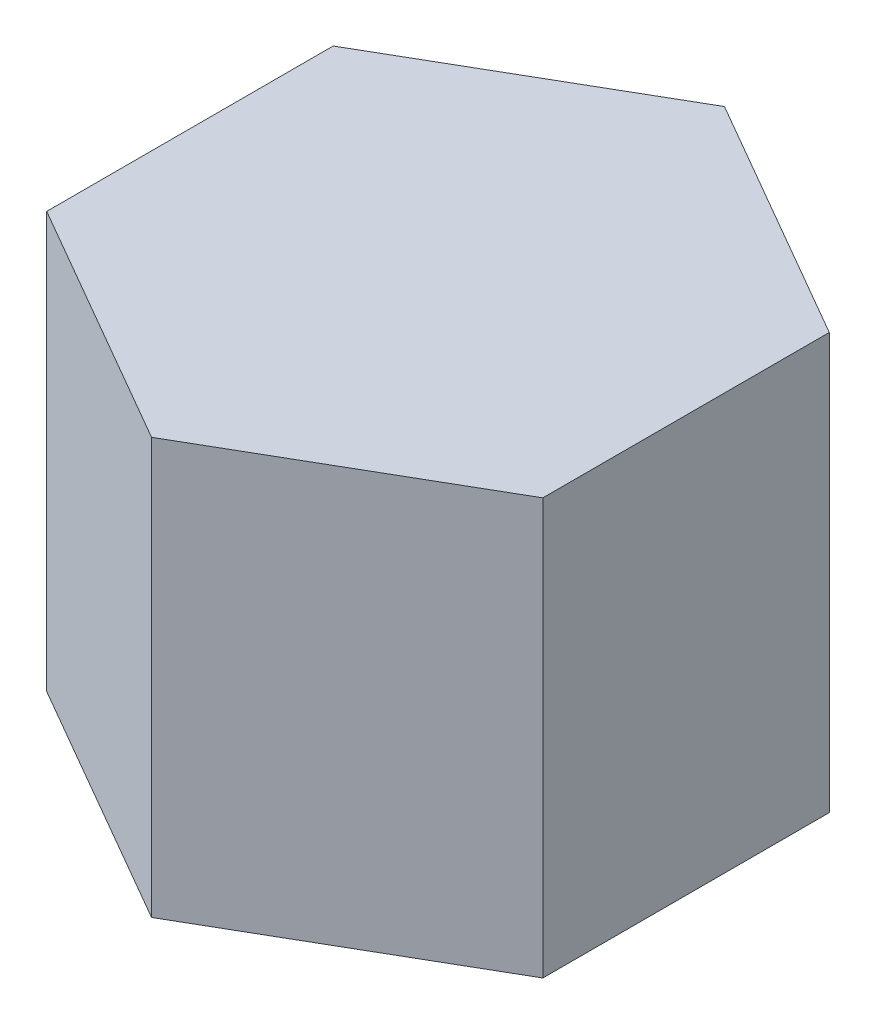
ISO-10303-21;
HEADER;
FILE_DESCRIPTION(('STEP AP214'),'2;1');
FILE_NAME('part.step','',(''),(''),'','','');
FILE_SCHEMA(('AUTOMOTIVE_DESIGN { 1 0 10303 214 1 1 1 1 }'));
ENDSEC;
DATA;
#1=APPLICATION_CONTEXT('core data for automotive mechanical design processes');
#2=APPLICATION_PROTOCOL_DEFINITION('international standard','automotive_design',2000,#1);
#3=PRODUCT_CONTEXT('',#1,'mechanical');
#4=PRODUCT('Part','Part','',(#3));
#5=PRODUCT_RELATED_PRODUCT_CATEGORY('part','',(#4));
#6=PRODUCT_DEFINITION_FORMATION('','',#4);
#7=PRODUCT_DEFINITION_CONTEXT('part definition',#1,'design');
#8=PRODUCT_DEFINITION('design','',#6,#7);
#9=PRODUCT_DEFINITION_SHAPE('','',#8);
#10=(LENGTH_UNIT() NAMED_UNIT(*) SI_UNIT(.MILLI.,.METRE.));
#11=(NAMED_UNIT(*) PLANE_ANGLE_UNIT() SI_UNIT($,.RADIAN.));
#12=(NAMED_UNIT(*) SI_UNIT($,.STERADIAN.) SOLID_ANGLE_UNIT());
#13=UNCERTAINTY_MEASURE_WITH_UNIT(LENGTH_MEASURE(1.E-05),#10,'distance_accuracy_value','');
#14=(GEOMETRIC_REPRESENTATION_CONTEXT(3) GLOBAL_UNCERTAINTY_ASSIGNED_CONTEXT((#13)) GLOBAL_UNIT_ASSIGNED_CONTEXT((#10,
#11,#12)) REPRESENTATION_CONTEXT('',''));
#15=CARTESIAN_POINT('',(0.,0.,0.));
#16=DIRECTION('',(0.,0.,1.));
#17=DIRECTION('',(1.,0.,0.));
#18=AXIS2_PLACEMENT_3D('',#15,#16,#17);
#19=CARTESIAN_POINT('',(209.642660308706,-148.537700895744,293.239022028063));
#20=DIRECTION('',(-0.499999999999909,0.,-0.866025403784491));
#21=DIRECTION('',(-0.866025403784491,0.,0.499999999999909));
#22=AXIS2_PLACEMENT_3D('',#19,#20,#21);
#23=PLANE('',#22);
#24=CARTESIAN_POINT('',(209.339551417382,-149.045793579175,293.414022028063));
#25=DIRECTION('',(0.866025403784491,0.,-0.499999999999909));
#26=VECTOR('',#25,1.);
#27=LINE('',#24,#26);
#28=CARTESIAN_POINT('',(209.339551417382,-149.045793579175,293.414022028063));
#29=VERTEX_POINT('',#28);
#30=CARTESIAN_POINT('',(209.642660308706,-149.045793579175,293.239022028063));
#31=VERTEX_POINT('',#30);
#32=EDGE_CURVE('E170',#29,#31,#27,.T.);
#33=ORIENTED_EDGE('',*,*,#32,.T.);
#34=CARTESIAN_POINT('',(209.642660308706,-148.537700895744,293.239022028063));
#35=DIRECTION('',(0.,-1.,0.));
#36=VECTOR('',#35,1.);
#37=LINE('',#34,#36);
#38=CARTESIAN_POINT('',(209.642660308706,-148.537700895744,293.239022028063));
#39=VERTEX_POINT('',#38);
#40=EDGE_CURVE('E35',#39,#31,#37,.T.);
#41=ORIENTED_EDGE('',*,*,#40,.F.);
#42=CARTESIAN_POINT('',(209.339551417382,-148.537700895744,293.414022028063));
#43=DIRECTION('',(0.866025403784491,0.,-0.499999999999909));
#44=VECTOR('',#43,1.);
#45=LINE('',#42,#44);
#46=CARTESIAN_POINT('',(209.339551417382,-148.537700895744,293.414022028063));
#47=VERTEX_POINT('',#46);
#48=EDGE_CURVE('E159',#47,#39,#45,.T.);
#49=ORIENTED_EDGE('',*,*,#48,.F.);
#50=CARTESIAN_POINT('',(209.339551417382,-148.537700895744,293.414022028063));
#51=DIRECTION('',(0.,-1.,0.));
#52=VECTOR('',#51,1.);
#53=LINE('',#50,#52);
#54=EDGE_CURVE('E10',#47,#29,#53,.T.);
#55=ORIENTED_EDGE('',*,*,#54,.T.);
#56=EDGE_LOOP('',(#33,#41,#49,#55));
#57=FACE_BOUND('',#56,.T.);
#58=ADVANCED_FACE('F16',(#57),#23,.F.);
#59=CARTESIAN_POINT('',(209.339551417382,-148.537700895744,293.414022028063));
#60=DIRECTION('',(0.500000000000096,0.,-0.866025403784383));
#61=DIRECTION('',(-0.866025403784383,0.,-0.500000000000096));
#62=AXIS2_PLACEMENT_3D('',#59,#60,#61);
#63=PLANE('',#62);
#64=CARTESIAN_POINT('',(209.036442526057,-149.045793579175,293.239022028063));
#65=DIRECTION('',(0.866025403784383,0.,0.500000000000096));
#66=VECTOR('',#65,1.);
#67=LINE('',#64,#66);
#68=CARTESIAN_POINT('',(209.036442526057,-149.045793579175,293.239022028063));
#69=VERTEX_POINT('',#68);
#70=EDGE_CURVE('E167',#69,#29,#67,.T.);
#71=ORIENTED_EDGE('',*,*,#70,.T.);
#72=ORIENTED_EDGE('',*,*,#54,.F.);
#73=CARTESIAN_POINT('',(209.036442526057,-148.537700895744,293.239022028063));
#74=DIRECTION('',(0.866025403784383,0.,0.500000000000096));
#75=VECTOR('',#74,1.);
#76=LINE('',#73,#75);
#77=CARTESIAN_POINT('',(209.036442526057,-148.537700895744,293.239022028063));
#78=VERTEX_POINT('',#77);
#79=EDGE_CURVE('E156',#78,#47,#76,.T.);
#80=ORIENTED_EDGE('',*,*,#79,.F.);
#81=CARTESIAN_POINT('',(209.036442526057,-148.537700895744,293.239022028063));
#82=DIRECTION('',(0.,-1.,0.));
#83=VECTOR('',#82,1.);
#84=LINE('',#81,#83);
#85=EDGE_CURVE('E27',#78,#69,#84,.T.);
#86=ORIENTED_EDGE('',*,*,#85,.T.);
#87=EDGE_LOOP('',(#71,#72,#80,#86));
#88=FACE_BOUND('',#87,.T.);
#89=ADVANCED_FACE('F189',(#88),#63,.F.);
#90=CARTESIAN_POINT('',(209.036442526057,-148.537700895744,290.831971220494));
#91=DIRECTION('',(1.,0.,0.));
#92=DIRECTION('',(0.,1.,0.));
#93=AXIS2_PLACEMENT_3D('',#90,#91,#92);
#94=PLANE('',#93);
#95=CARTESIAN_POINT('',(209.036442526057,-149.045793579175,292.889022028063));
#96=DIRECTION('',(0.,0.,1.));
#97=VECTOR('',#96,1.);
#98=LINE('',#95,#97);
#99=CARTESIAN_POINT('',(209.036442526057,-149.045793579175,292.889022028063));
#100=VERTEX_POINT('',#99);
#101=EDGE_CURVE('E163',#100,#69,#98,.T.);
#102=ORIENTED_EDGE('',*,*,#101,.T.);
#103=ORIENTED_EDGE('',*,*,#85,.F.);
#104=CARTESIAN_POINT('',(209.036442526057,-148.537700895744,292.889022028063));
#105=DIRECTION('',(0.,0.,1.));
#106=VECTOR('',#105,1.);
#107=LINE('',#104,#106);
#108=CARTESIAN_POINT('',(209.036442526057,-148.537700895744,292.889022028063));
#109=VERTEX_POINT('',#108);
#110=EDGE_CURVE('E106',#109,#78,#107,.T.);
#111=ORIENTED_EDGE('',*,*,#110,.F.);
#112=CARTESIAN_POINT('',(209.036442526057,-148.537700895744,292.889022028063));
#113=DIRECTION('',(0.,-1.,0.));
#114=VECTOR('',#113,1.);
#115=LINE('',#112,#114);
#116=EDGE_CURVE('E94',#109,#100,#115,.T.);
#117=ORIENTED_EDGE('',*,*,#116,.T.);
#118=EDGE_LOOP('',(#102,#103,#111,#117));
#119=FACE_BOUND('',#118,.T.);
#120=ADVANCED_FACE('F198',(#119),#94,.F.);
#121=CARTESIAN_POINT('',(209.036442526057,-148.537700895744,292.889022028063));
#122=DIRECTION('',(0.499999999999943,0.,0.866025403784472));
#123=DIRECTION('',(0.866025403784472,0.,-0.499999999999943));
#124=AXIS2_PLACEMENT_3D('',#121,#122,#123);
#125=PLANE('',#124);
#126=CARTESIAN_POINT('',(209.339551417382,-149.045793579175,292.714022028063));
#127=DIRECTION('',(-0.866025403784471,0.,0.499999999999943));
#128=VECTOR('',#127,1.);
#129=LINE('',#126,#128);
#130=CARTESIAN_POINT('',(209.339551417382,-149.045793579175,292.714022028063));
#131=VERTEX_POINT('',#130);
#132=EDGE_CURVE('E162',#131,#100,#129,.T.);
#133=ORIENTED_EDGE('',*,*,#132,.T.);
#134=ORIENTED_EDGE('',*,*,#116,.F.);
#135=CARTESIAN_POINT('',(209.339551417382,-148.537700895744,292.714022028063));
#136=DIRECTION('',(-0.866025403784471,0.,0.499999999999943));
#137=VECTOR('',#136,1.);
#138=LINE('',#135,#137);
#139=CARTESIAN_POINT('',(209.339551417382,-148.537700895744,292.714022028063));
#140=VERTEX_POINT('',#139);
#141=EDGE_CURVE('E98',#140,#109,#138,.T.);
#142=ORIENTED_EDGE('',*,*,#141,.F.);
#143=CARTESIAN_POINT('',(209.339551417382,-148.537700895744,292.714022028063));
#144=DIRECTION('',(0.,-1.,0.));
#145=VECTOR('',#144,1.);
#146=LINE('',#143,#145);
#147=EDGE_CURVE('E79',#140,#131,#146,.T.);
#148=ORIENTED_EDGE('',*,*,#147,.T.);
#149=EDGE_LOOP('',(#133,#134,#142,#148));
#150=FACE_BOUND('',#149,.T.);
#151=ADVANCED_FACE('F100',(#150),#125,.F.);
#152=CARTESIAN_POINT('',(209.339551417382,-148.537700895744,292.714022028063));
#153=DIRECTION('',(-0.500000000000062,0.,0.866025403784403));
#154=DIRECTION('',(0.866025403784403,0.,0.500000000000062));
#155=AXIS2_PLACEMENT_3D('',#152,#153,#154);
#156=PLANE('',#155);
#157=CARTESIAN_POINT('',(209.642660308706,-149.045793579175,292.889022028063));
#158=DIRECTION('',(-0.866025403784403,0.,-0.500000000000062));
#159=VECTOR('',#158,1.);
#160=LINE('',#157,#159);
#161=CARTESIAN_POINT('',(209.642660308706,-149.045793579175,292.889022028063));
#162=VERTEX_POINT('',#161);
#163=EDGE_CURVE('E88',#162,#131,#160,.T.);
#164=ORIENTED_EDGE('',*,*,#163,.T.);
#165=ORIENTED_EDGE('',*,*,#147,.F.);
#166=CARTESIAN_POINT('',(209.642660308706,-148.537700895744,292.889022028063));
#167=DIRECTION('',(-0.866025403784403,0.,-0.500000000000062));
#168=VECTOR('',#167,1.);
#169=LINE('',#166,#168);
#170=CARTESIAN_POINT('',(209.642660308706,-148.537700895744,292.889022028063));
#171=VERTEX_POINT('',#170);
#172=EDGE_CURVE('E84',#171,#140,#169,.T.);
#173=ORIENTED_EDGE('',*,*,#172,.F.);
#174=CARTESIAN_POINT('',(209.642660308706,-148.537700895744,292.889022028063));
#175=DIRECTION('',(0.,-1.,0.));
#176=VECTOR('',#175,1.);
#177=LINE('',#174,#176);
#178=EDGE_CURVE('E58',#171,#162,#177,.T.);
#179=ORIENTED_EDGE('',*,*,#178,.T.);
#180=EDGE_LOOP('',(#164,#165,#173,#179));
#181=FACE_BOUND('',#180,.T.);
#182=ADVANCED_FACE('F82',(#181),#156,.F.);
#183=CARTESIAN_POINT('',(209.642660308706,-148.537700895744,290.831971220494));
#184=DIRECTION('',(-1.,0.,0.));
#185=DIRECTION('',(0.,-1.,0.));
#186=AXIS2_PLACEMENT_3D('',#183,#184,#185);
#187=PLANE('',#186);
#188=CARTESIAN_POINT('',(209.642660308706,-149.045793579175,293.239022028063));
#189=DIRECTION('',(0.,0.,-1.));
#190=VECTOR('',#189,1.);
#191=LINE('',#188,#190);
#192=EDGE_CURVE('E160',#31,#162,#191,.T.);
#193=ORIENTED_EDGE('',*,*,#192,.T.);
#194=ORIENTED_EDGE('',*,*,#178,.F.);
#195=CARTESIAN_POINT('',(209.642660308706,-148.537700895744,293.239022028063));
#196=DIRECTION('',(0.,0.,-1.));
#197=VECTOR('',#196,1.);
#198=LINE('',#195,#197);
#199=EDGE_CURVE('E112',#39,#171,#198,.T.);
#200=ORIENTED_EDGE('',*,*,#199,.F.);
#201=ORIENTED_EDGE('',*,*,#40,.T.);
#202=EDGE_LOOP('',(#193,#194,#200,#201));
#203=FACE_BOUND('',#202,.T.);
#204=ADVANCED_FACE('F131',(#203),#187,.F.);
#205=CARTESIAN_POINT('',(206.339551417382,-148.537700895744,290.831971220494));
#206=DIRECTION('',(0.,-1.,0.));
#207=DIRECTION('',(1.,0.,0.));
#208=AXIS2_PLACEMENT_3D('',#205,#206,#207);
#209=PLANE('',#208);
#210=ORIENTED_EDGE('',*,*,#48,.T.);
#211=ORIENTED_EDGE('',*,*,#199,.T.);
#212=ORIENTED_EDGE('',*,*,#172,.T.);
#213=ORIENTED_EDGE('',*,*,#141,.T.);
#214=ORIENTED_EDGE('',*,*,#110,.T.);
#215=ORIENTED_EDGE('',*,*,#79,.T.);
#216=EDGE_LOOP('',(#210,#211,#212,#213,#214,#215));
#217=FACE_BOUND('',#216,.T.);
#218=ADVANCED_FACE('F111',(#217),#209,.F.);
#219=CARTESIAN_POINT('',(206.339551417382,-149.045793579175,290.831971220494));
#220=DIRECTION('',(0.,-1.,0.));
#221=DIRECTION('',(1.,0.,0.));
#222=AXIS2_PLACEMENT_3D('',#219,#220,#221);
#223=PLANE('',#222);
#224=ORIENTED_EDGE('',*,*,#32,.F.);
#225=ORIENTED_EDGE('',*,*,#70,.F.);
#226=ORIENTED_EDGE('',*,*,#101,.F.);
#227=ORIENTED_EDGE('',*,*,#132,.F.);
#228=ORIENTED_EDGE('',*,*,#163,.F.);
#229=ORIENTED_EDGE('',*,*,#192,.F.);
#230=EDGE_LOOP('',(#224,#225,#226,#227,#228,#229));
#231=FACE_BOUND('',#230,.T.);
#232=ADVANCED_FACE('F130',(#231),#223,.T.);
#233=CLOSED_SHELL('',(#58,#89,#120,#151,#182,#204,#218,#232));
#234=MANIFOLD_SOLID_BREP('B1',#233);
#235=ADVANCED_BREP_SHAPE_REPRESENTATION('',(#18,#234),#14);
#236=SHAPE_DEFINITION_REPRESENTATION(#9,#235);
ENDSEC;
END-ISO-10303-21;
